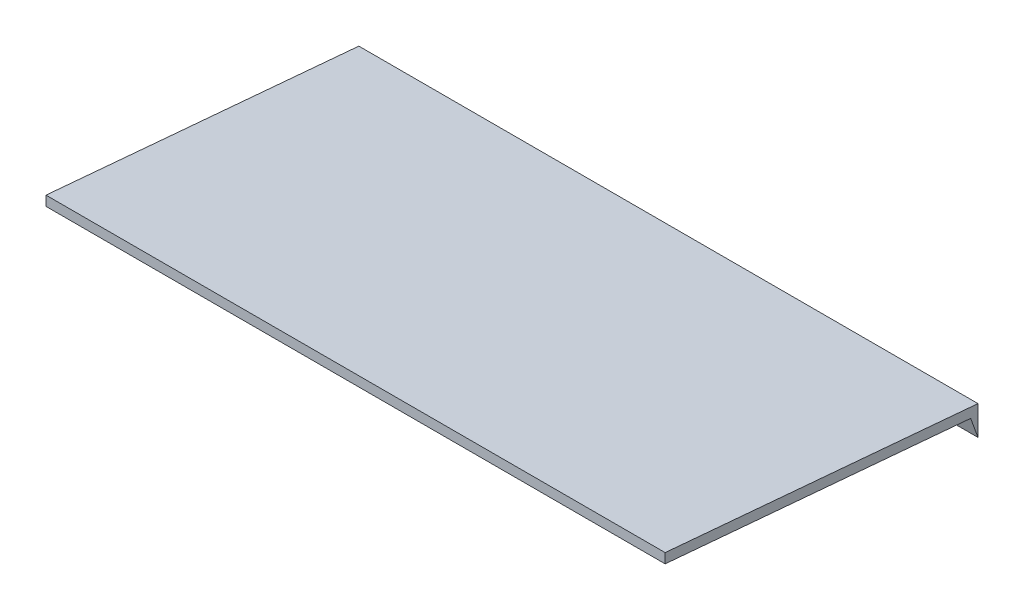
ISO-10303-21;
HEADER;
FILE_DESCRIPTION(('STEP AP214'),'2;1');
FILE_NAME('part.step','',(''),(''),'','','');
FILE_SCHEMA(('AUTOMOTIVE_DESIGN { 1 0 10303 214 1 1 1 1 }'));
ENDSEC;
DATA;
#1=APPLICATION_CONTEXT('core data for automotive mechanical design processes');
#2=APPLICATION_PROTOCOL_DEFINITION('international standard','automotive_design',2000,#1);
#3=PRODUCT_CONTEXT('',#1,'mechanical');
#4=PRODUCT('Part','Part','',(#3));
#5=PRODUCT_RELATED_PRODUCT_CATEGORY('part','',(#4));
#6=PRODUCT_DEFINITION_FORMATION('','',#4);
#7=PRODUCT_DEFINITION_CONTEXT('part definition',#1,'design');
#8=PRODUCT_DEFINITION('design','',#6,#7);
#9=PRODUCT_DEFINITION_SHAPE('','',#8);
#10=(LENGTH_UNIT() NAMED_UNIT(*) SI_UNIT(.MILLI.,.METRE.));
#11=(NAMED_UNIT(*) PLANE_ANGLE_UNIT() SI_UNIT($,.RADIAN.));
#12=(NAMED_UNIT(*) SI_UNIT($,.STERADIAN.) SOLID_ANGLE_UNIT());
#13=UNCERTAINTY_MEASURE_WITH_UNIT(LENGTH_MEASURE(1.E-05),#10,'distance_accuracy_value','');
#14=(GEOMETRIC_REPRESENTATION_CONTEXT(3) GLOBAL_UNCERTAINTY_ASSIGNED_CONTEXT((#13)) GLOBAL_UNIT_ASSIGNED_CONTEXT((#10,
#11,#12)) REPRESENTATION_CONTEXT('',''));
#15=CARTESIAN_POINT('',(0.,0.,0.));
#16=DIRECTION('',(0.,0.,1.));
#17=DIRECTION('',(1.,0.,0.));
#18=AXIS2_PLACEMENT_3D('',#15,#16,#17);
#19=CARTESIAN_POINT('',(3.16666666666667,-0.1,0.));
#20=DIRECTION('',(0.,0.,-1.));
#21=DIRECTION('',(-1.,0.,0.));
#22=AXIS2_PLACEMENT_3D('',#19,#20,#21);
#23=PLANE('',#22);
#24=DIRECTION('',(0.,-1.,0.));
#25=VECTOR('',#24,1.);
#26=CARTESIAN_POINT('',(-3.16666666666667,-0.1,0.));
#27=LINE('',#26,#25);
#28=CARTESIAN_POINT('',(-3.16666666666667,0.,0.));
#29=VERTEX_POINT('',#28);
#30=CARTESIAN_POINT('',(-3.16666666666667,-0.1,0.));
#31=VERTEX_POINT('',#30);
#32=EDGE_CURVE('E104',#29,#31,#27,.T.);
#33=ORIENTED_EDGE('',*,*,#32,.T.);
#34=DIRECTION('',(-1.,0.,0.));
#35=VECTOR('',#34,1.);
#36=CARTESIAN_POINT('',(3.16666666666667,-0.1,0.));
#37=LINE('',#36,#35);
#38=CARTESIAN_POINT('',(3.16666666666667,-0.1,0.));
#39=VERTEX_POINT('',#38);
#40=EDGE_CURVE('E11',#39,#31,#37,.T.);
#41=ORIENTED_EDGE('',*,*,#40,.F.);
#42=DIRECTION('',(0.,-1.,0.));
#43=VECTOR('',#42,1.);
#44=CARTESIAN_POINT('',(3.16666666666667,-0.1,0.));
#45=LINE('',#44,#43);
#46=CARTESIAN_POINT('',(3.16666666666667,0.,0.));
#47=VERTEX_POINT('',#46);
#48=EDGE_CURVE('E112',#47,#39,#45,.T.);
#49=ORIENTED_EDGE('',*,*,#48,.F.);
#50=DIRECTION('',(-1.,0.,0.));
#51=VECTOR('',#50,1.);
#52=CARTESIAN_POINT('',(3.16666666666667,0.,0.));
#53=LINE('',#52,#51);
#54=EDGE_CURVE('E100',#47,#29,#53,.T.);
#55=ORIENTED_EDGE('',*,*,#54,.T.);
#56=EDGE_LOOP('',(#33,#41,#49,#55));
#57=FACE_BOUND('',#56,.T.);
#58=ADVANCED_FACE('F30',(#57),#23,.F.);
#59=CARTESIAN_POINT('',(3.16666666666667,-0.373385600474661,-3.12481171224719));
#60=DIRECTION('',(0.,0.996194698091746,-0.0871557427476582));
#61=DIRECTION('',(0.,0.0871557427476582,0.996194698091746));
#62=AXIS2_PLACEMENT_3D('',#59,#60,#61);
#63=PLANE('',#62);
#64=DIRECTION('',(0.,-0.0871557427476582,-0.996194698091746));
#65=VECTOR('',#64,1.);
#66=CARTESIAN_POINT('',(-3.16666666666667,-0.373385600474661,-3.12481171224719));
#67=LINE('',#66,#65);
#68=CARTESIAN_POINT('',(-3.16666666666667,-0.373385600474661,-3.12481171224719));
#69=VERTEX_POINT('',#68);
#70=EDGE_CURVE('E107',#31,#69,#67,.T.);
#71=ORIENTED_EDGE('',*,*,#70,.T.);
#72=DIRECTION('',(-1.,0.,0.));
#73=VECTOR('',#72,1.);
#74=CARTESIAN_POINT('',(3.16666666666667,-0.373385600474661,-3.12481171224719));
#75=LINE('',#74,#73);
#76=CARTESIAN_POINT('',(3.16666666666667,-0.373385600474661,-3.12481171224719));
#77=VERTEX_POINT('',#76);
#78=EDGE_CURVE('E38',#77,#69,#75,.T.);
#79=ORIENTED_EDGE('',*,*,#78,.F.);
#80=DIRECTION('',(0.,-0.0871557427476582,-0.996194698091746));
#81=VECTOR('',#80,1.);
#82=CARTESIAN_POINT('',(3.16666666666667,-0.373385600474661,-3.12481171224719));
#83=LINE('',#82,#81);
#84=EDGE_CURVE('E80',#39,#77,#83,.T.);
#85=ORIENTED_EDGE('',*,*,#84,.F.);
#86=ORIENTED_EDGE('',*,*,#40,.T.);
#87=EDGE_LOOP('',(#71,#79,#85,#86));
#88=FACE_BOUND('',#87,.T.);
#89=ADVANCED_FACE('F131',(#88),#63,.F.);
#90=CARTESIAN_POINT('',(3.16666666666667,-0.579963723282958,-3.2));
#91=DIRECTION('',(0.,0.342020143325669,-0.939692620785908));
#92=DIRECTION('',(0.,0.939692620785908,0.342020143325669));
#93=AXIS2_PLACEMENT_3D('',#90,#91,#92);
#94=PLANE('',#93);
#95=DIRECTION('',(0.,-0.939692620785908,-0.342020143325669));
#96=VECTOR('',#95,1.);
#97=CARTESIAN_POINT('',(-3.16666666666667,-0.579963723282958,-3.2));
#98=LINE('',#97,#96);
#99=CARTESIAN_POINT('',(-3.16666666666667,-0.579963723282958,-3.2));
#100=VERTEX_POINT('',#99);
#101=EDGE_CURVE('E95',#69,#100,#98,.T.);
#102=ORIENTED_EDGE('',*,*,#101,.T.);
#103=DIRECTION('',(-1.,0.,0.));
#104=VECTOR('',#103,1.);
#105=CARTESIAN_POINT('',(3.16666666666667,-0.579963723282958,-3.2));
#106=LINE('',#105,#104);
#107=CARTESIAN_POINT('',(3.16666666666667,-0.579963723282958,-3.2));
#108=VERTEX_POINT('',#107);
#109=EDGE_CURVE('E92',#108,#100,#106,.T.);
#110=ORIENTED_EDGE('',*,*,#109,.F.);
#111=DIRECTION('',(0.,-0.939692620785908,-0.342020143325669));
#112=VECTOR('',#111,1.);
#113=CARTESIAN_POINT('',(3.16666666666667,-0.579963723282958,-3.2));
#114=LINE('',#113,#112);
#115=EDGE_CURVE('E84',#77,#108,#114,.T.);
#116=ORIENTED_EDGE('',*,*,#115,.F.);
#117=ORIENTED_EDGE('',*,*,#78,.T.);
#118=EDGE_LOOP('',(#102,#110,#116,#117));
#119=FACE_BOUND('',#118,.T.);
#120=ADVANCED_FACE('F93',(#119),#94,.F.);
#121=CARTESIAN_POINT('',(3.16666666666667,-0.279963723282958,-3.2));
#122=DIRECTION('',(0.,0.,1.));
#123=DIRECTION('',(1.,0.,0.));
#124=AXIS2_PLACEMENT_3D('',#121,#122,#123);
#125=PLANE('',#124);
#126=DIRECTION('',(0.,1.,0.));
#127=VECTOR('',#126,1.);
#128=CARTESIAN_POINT('',(-3.16666666666667,-0.279963723282958,-3.2));
#129=LINE('',#128,#127);
#130=CARTESIAN_POINT('',(-3.16666666666667,-0.279963723282958,-3.2));
#131=VERTEX_POINT('',#130);
#132=EDGE_CURVE('E66',#100,#131,#129,.T.);
#133=ORIENTED_EDGE('',*,*,#132,.T.);
#134=DIRECTION('',(-1.,0.,0.));
#135=VECTOR('',#134,1.);
#136=CARTESIAN_POINT('',(3.16666666666667,-0.279963723282958,-3.2));
#137=LINE('',#136,#135);
#138=CARTESIAN_POINT('',(3.16666666666667,-0.279963723282958,-3.2));
#139=VERTEX_POINT('',#138);
#140=EDGE_CURVE('E96',#139,#131,#137,.T.);
#141=ORIENTED_EDGE('',*,*,#140,.F.);
#142=DIRECTION('',(0.,1.,0.));
#143=VECTOR('',#142,1.);
#144=CARTESIAN_POINT('',(3.16666666666667,-0.279963723282958,-3.2));
#145=LINE('',#144,#143);
#146=EDGE_CURVE('E88',#108,#139,#145,.T.);
#147=ORIENTED_EDGE('',*,*,#146,.F.);
#148=ORIENTED_EDGE('',*,*,#109,.T.);
#149=EDGE_LOOP('',(#133,#141,#147,#148));
#150=FACE_BOUND('',#149,.T.);
#151=ADVANCED_FACE('F98',(#150),#125,.F.);
#152=CARTESIAN_POINT('',(3.16666666666667,0.,0.));
#153=DIRECTION('',(0.,-0.996194698091745,0.0871557427476584));
#154=DIRECTION('',(0.,-0.0871557427476584,-0.996194698091746));
#155=AXIS2_PLACEMENT_3D('',#152,#153,#154);
#156=PLANE('',#155);
#157=DIRECTION('',(0.,0.0871557427476584,0.996194698091745));
#158=VECTOR('',#157,1.);
#159=CARTESIAN_POINT('',(-3.16666666666667,0.,0.));
#160=LINE('',#159,#158);
#161=EDGE_CURVE('E72',#131,#29,#160,.T.);
#162=ORIENTED_EDGE('',*,*,#161,.T.);
#163=ORIENTED_EDGE('',*,*,#54,.F.);
#164=DIRECTION('',(0.,0.0871557427476584,0.996194698091745));
#165=VECTOR('',#164,1.);
#166=CARTESIAN_POINT('',(3.16666666666667,0.,0.));
#167=LINE('',#166,#165);
#168=EDGE_CURVE('E46',#139,#47,#167,.T.);
#169=ORIENTED_EDGE('',*,*,#168,.F.);
#170=ORIENTED_EDGE('',*,*,#140,.T.);
#171=EDGE_LOOP('',(#162,#163,#169,#170));
#172=FACE_BOUND('',#171,.T.);
#173=ADVANCED_FACE('F120',(#172),#156,.F.);
#174=CARTESIAN_POINT('',(3.16666666666667,0.,0.));
#175=DIRECTION('',(-1.,0.,0.));
#176=DIRECTION('',(0.,0.,1.));
#177=AXIS2_PLACEMENT_3D('',#174,#175,#176);
#178=PLANE('',#177);
#179=ORIENTED_EDGE('',*,*,#48,.T.);
#180=ORIENTED_EDGE('',*,*,#84,.T.);
#181=ORIENTED_EDGE('',*,*,#115,.T.);
#182=ORIENTED_EDGE('',*,*,#146,.T.);
#183=ORIENTED_EDGE('',*,*,#168,.T.);
#184=EDGE_LOOP('',(#179,#180,#181,#182,#183));
#185=FACE_BOUND('',#184,.T.);
#186=ADVANCED_FACE('F86',(#185),#178,.F.);
#187=CARTESIAN_POINT('',(-3.16666666666667,0.,0.));
#188=DIRECTION('',(-1.,0.,0.));
#189=DIRECTION('',(0.,0.,1.));
#190=AXIS2_PLACEMENT_3D('',#187,#188,#189);
#191=PLANE('',#190);
#192=ORIENTED_EDGE('',*,*,#32,.F.);
#193=ORIENTED_EDGE('',*,*,#161,.F.);
#194=ORIENTED_EDGE('',*,*,#132,.F.);
#195=ORIENTED_EDGE('',*,*,#101,.F.);
#196=ORIENTED_EDGE('',*,*,#70,.F.);
#197=EDGE_LOOP('',(#192,#193,#194,#195,#196));
#198=FACE_BOUND('',#197,.T.);
#199=ADVANCED_FACE('F116',(#198),#191,.T.);
#200=CLOSED_SHELL('',(#58,#89,#120,#151,#173,#186,#199));
#201=MANIFOLD_SOLID_BREP('B2',#200);
#202=ADVANCED_BREP_SHAPE_REPRESENTATION('',(#18,#201),#14);
#203=SHAPE_DEFINITION_REPRESENTATION(#9,#202);
ENDSEC;
END-ISO-10303-21;
